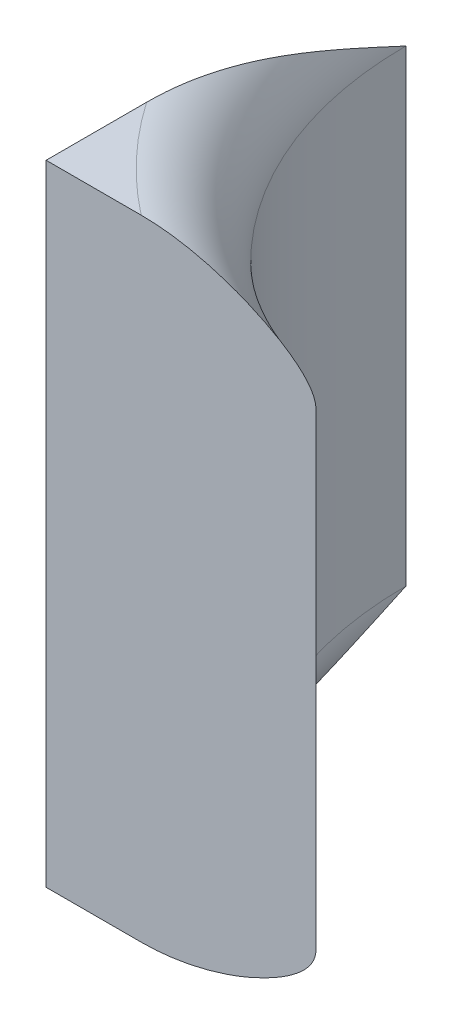
ISO-10303-21;
HEADER;
FILE_DESCRIPTION(('STEP AP214'),'2;1');
FILE_NAME('part.step','',(''),(''),'','','');
FILE_SCHEMA(('AUTOMOTIVE_DESIGN { 1 0 10303 214 1 1 1 1 }'));
ENDSEC;
DATA;
#1=APPLICATION_CONTEXT('core data for automotive mechanical design processes');
#2=APPLICATION_PROTOCOL_DEFINITION('international standard','automotive_design',2000,#1);
#3=PRODUCT_CONTEXT('',#1,'mechanical');
#4=PRODUCT('Part','Part','',(#3));
#5=PRODUCT_RELATED_PRODUCT_CATEGORY('part','',(#4));
#6=PRODUCT_DEFINITION_FORMATION('','',#4);
#7=PRODUCT_DEFINITION_CONTEXT('part definition',#1,'design');
#8=PRODUCT_DEFINITION('design','',#6,#7);
#9=PRODUCT_DEFINITION_SHAPE('','',#8);
#10=(LENGTH_UNIT() NAMED_UNIT(*) SI_UNIT(.MILLI.,.METRE.));
#11=(NAMED_UNIT(*) PLANE_ANGLE_UNIT() SI_UNIT($,.RADIAN.));
#12=(NAMED_UNIT(*) SI_UNIT($,.STERADIAN.) SOLID_ANGLE_UNIT());
#13=UNCERTAINTY_MEASURE_WITH_UNIT(LENGTH_MEASURE(1.E-05),#10,'distance_accuracy_value','');
#14=(GEOMETRIC_REPRESENTATION_CONTEXT(3) GLOBAL_UNCERTAINTY_ASSIGNED_CONTEXT((#13)) GLOBAL_UNIT_ASSIGNED_CONTEXT((#10,
#11,#12)) REPRESENTATION_CONTEXT('',''));
#15=CARTESIAN_POINT('',(0.,0.,0.));
#16=DIRECTION('',(0.,0.,1.));
#17=DIRECTION('',(1.,0.,0.));
#18=AXIS2_PLACEMENT_3D('',#15,#16,#17);
#19=CARTESIAN_POINT('',(-8.18333333333,4.66,-7.4));
#20=DIRECTION('',(0.,1.,0.));
#21=DIRECTION('',(0.,0.,1.));
#22=AXIS2_PLACEMENT_3D('',#19,#20,#21);
#23=TOROIDAL_SURFACE('',#22,0.506666666666999,0.0899999999999992);
#24=CARTESIAN_POINT('',(-8.6,4.75,-7.11172929389331));
#25=CARTESIAN_POINT('',(-8.60000000000004,4.74999182842818,-7.12226420750381));
#26=CARTESIAN_POINT('',(-8.60000000000002,4.74940282433437,-7.13277700192456));
#27=CARTESIAN_POINT('',(-8.59999999999998,4.74726599111461,-7.15367604192472));
#28=CARTESIAN_POINT('',(-8.59999999999996,4.7457210217608,-7.16406257107873));
#29=CARTESIAN_POINT('',(-8.60000000000008,4.73999308609058,-7.19476484291107));
#30=CARTESIAN_POINT('',(-8.60000000000041,4.73470744792433,-7.21486900485835));
#31=CARTESIAN_POINT('',(-8.59999999999942,4.71974800515174,-7.26244598700282));
#32=CARTESIAN_POINT('',(-8.59999999999739,4.70916406833894,-7.28961338372367));
#33=CARTESIAN_POINT('',(-8.60000000000262,4.68630890961603,-7.34329374460435));
#34=CARTESIAN_POINT('',(-8.60000000000991,4.67403179600395,-7.36980402462256));
#35=CARTESIAN_POINT('',(-8.59999999999954,4.66114707398826,-7.39753187914524));
#36=CARTESIAN_POINT('',(-8.59999999999904,4.66057353385867,-7.39876593924196));
#37=CARTESIAN_POINT('',(-8.5999999999985,4.66,-7.4));
#38=B_SPLINE_CURVE_WITH_KNOTS('',3,(#24,#25,#26,#27,#28,#29,#30,#31,#32,#33,#34,#35,#36,#37),
.UNSPECIFIED.,.F.,.F.,(4,2,2,2,2,2,4),(0.,0.03155687643443,0.0630198037860994,0.125216483289171,
0.212547910956125,0.300191273586357,0.304273756561998),.UNSPECIFIED.);
#39=CARTESIAN_POINT('',(-8.6,4.75,-7.11172929389477));
#40=VERTEX_POINT('',#39);
#41=CARTESIAN_POINT('',(-8.5999999999985,4.66,-7.4));
#42=VERTEX_POINT('',#41);
#43=EDGE_CURVE('E67',#40,#42,#38,.T.);
#44=ORIENTED_EDGE('',*,*,#43,.F.);
#45=CARTESIAN_POINT('',(-8.18333333333,4.75,-7.4));
#46=DIRECTION('',(0.,1.,0.));
#47=DIRECTION('',(0.,0.,1.));
#48=AXIS2_PLACEMENT_3D('',#45,#46,#47);
#49=CIRCLE('',#48,0.506666666667);
#50=CARTESIAN_POINT('',(-8.49431743438948,4.75,-7.));
#51=VERTEX_POINT('',#50);
#52=EDGE_CURVE('E21',#51,#40,#49,.F.);
#53=ORIENTED_EDGE('',*,*,#52,.F.);
#54=CARTESIAN_POINT('',(-8.29999999999785,4.66,-7.));
#55=CARTESIAN_POINT('',(-8.2999924228672,4.66179744020447,-7.));
#56=CARTESIAN_POINT('',(-8.30019201367934,4.66358197983579,-7.));
#57=CARTESIAN_POINT('',(-8.300927010424,4.66704597855897,-7.));
#58=CARTESIAN_POINT('',(-8.30145576856262,4.66872681056904,-7.));
#59=CARTESIAN_POINT('',(-8.30298307668688,4.67248809473558,-7.));
#60=CARTESIAN_POINT('',(-8.30407698784922,4.67452839958886,-7.));
#61=CARTESIAN_POINT('',(-8.30656855223291,4.67843047637995,-7.));
#62=CARTESIAN_POINT('',(-8.30796881069487,4.68029050638506,-7.));
#63=CARTESIAN_POINT('',(-8.31323590592021,4.68656410542717,-7.));
#64=CARTESIAN_POINT('',(-8.3176064054637,4.69054368091173,-7.));
#65=CARTESIAN_POINT('',(-8.32682625249036,4.6978895207235,-7.));
#66=CARTESIAN_POINT('',(-8.33167814429885,4.70125222596013,-7.));
#67=CARTESIAN_POINT('',(-8.34367620686637,4.7088269994572,-7.));
#68=CARTESIAN_POINT('',(-8.35095494357624,4.71283059244185,-7.));
#69=CARTESIAN_POINT('',(-8.3658254122037,4.72021324720343,-7.));
#70=CARTESIAN_POINT('',(-8.37341767971984,4.72359118122704,-7.));
#71=CARTESIAN_POINT('',(-8.39649886587155,4.73286895184523,-7.));
#72=CARTESIAN_POINT('',(-8.41233477189956,4.7379375437972,-7.));
#73=CARTESIAN_POINT('',(-8.43925638048751,4.74438694776934,-7.));
#74=CARTESIAN_POINT('',(-8.45018585906077,4.7464327130057,-7.));
#75=CARTESIAN_POINT('',(-8.47217205192401,4.74923061064085,-7.));
#76=CARTESIAN_POINT('',(-8.48322828526269,4.74998661136524,-7.));
#77=CARTESIAN_POINT('',(-8.49431743438942,4.75,-7.));
#78=B_SPLINE_CURVE_WITH_KNOTS('',3,(#54,#55,#56,#57,#58,#59,#60,#61,#62,#63,#64,#65,#66,#67,#68,
#69,#70,#71,#72,#73,#74,#75,#76,#77),.UNSPECIFIED.,.F.,.F.,(4,2,2,2,2,2,2,2,2,2,2,4),(0.,
0.00536075382320547,0.0106166062475381,0.0175220325716459,0.0244886399425492,0.0420846993037856,
0.0597792898738582,0.0846486742987673,0.109562458701924,0.159243487630327,0.192536219053457,
0.225728920570611),.UNSPECIFIED.);
#79=CARTESIAN_POINT('',(-8.29999999999838,4.66,-6.99999999999984));
#80=VERTEX_POINT('',#79);
#81=EDGE_CURVE('E64',#80,#51,#78,.T.);
#82=ORIENTED_EDGE('',*,*,#81,.F.);
#83=CARTESIAN_POINT('',(-8.18333333332787,4.66,-7.4000000000016));
#84=DIRECTION('',(0.,1.,0.));
#85=DIRECTION('',(0.,0.,1.));
#86=AXIS2_PLACEMENT_3D('',#83,#84,#85);
#87=CIRCLE('',#86,0.416666666669132);
#88=EDGE_CURVE('E71',#42,#80,#87,.T.);
#89=ORIENTED_EDGE('',*,*,#88,.F.);
#90=EDGE_LOOP('',(#44,#53,#82,#89));
#91=FACE_BOUND('',#90,.T.);
#92=ADVANCED_FACE('F17',(#91),#23,.T.);
#93=CARTESIAN_POINT('',(-8.601,4.75,-7.11272929389202));
#94=DIRECTION('',(0.,1.,0.));
#95=DIRECTION('',(0.,0.,1.));
#96=AXIS2_PLACEMENT_3D('',#93,#94,#95);
#97=PLANE('',#96);
#98=DIRECTION('',(-1.,0.,0.));
#99=VECTOR('',#98,1.);
#100=CARTESIAN_POINT('',(-8.44999999999893,4.75,-7.));
#101=LINE('',#100,#99);
#102=CARTESIAN_POINT('',(-8.6,4.75,-7.));
#103=VERTEX_POINT('',#102);
#104=EDGE_CURVE('E73',#51,#103,#101,.T.);
#105=ORIENTED_EDGE('',*,*,#104,.F.);
#106=ORIENTED_EDGE('',*,*,#52,.T.);
#107=DIRECTION('',(0.,0.,-1.));
#108=VECTOR('',#107,1.);
#109=CARTESIAN_POINT('',(-8.6,4.75,-7.2));
#110=LINE('',#109,#108);
#111=EDGE_CURVE('E75',#103,#40,#110,.T.);
#112=ORIENTED_EDGE('',*,*,#111,.F.);
#113=EDGE_LOOP('',(#105,#106,#112));
#114=FACE_BOUND('',#113,.T.);
#115=ADVANCED_FACE('F74',(#114),#97,.T.);
#116=CARTESIAN_POINT('',(-8.18333333332787,4.66,-7.4000000000016));
#117=DIRECTION('',(0.,-1.,0.));
#118=DIRECTION('',(0.,0.,-1.));
#119=AXIS2_PLACEMENT_3D('',#116,#117,#118);
#120=CYLINDRICAL_SURFACE('',#119,0.416666666669132);
#121=CARTESIAN_POINT('',(-8.18333333333,4.14,-7.4));
#122=DIRECTION('',(0.,1.,0.));
#123=DIRECTION('',(0.,0.,1.));
#124=AXIS2_PLACEMENT_3D('',#121,#122,#123);
#125=CIRCLE('',#124,0.416666666666999);
#126=CARTESIAN_POINT('',(-8.5999999999985,4.14,-7.4));
#127=VERTEX_POINT('',#126);
#128=CARTESIAN_POINT('',(-8.29999999999893,4.14,-7.));
#129=VERTEX_POINT('',#128);
#130=EDGE_CURVE('E122',#127,#129,#125,.T.);
#131=ORIENTED_EDGE('',*,*,#130,.F.);
#132=DIRECTION('',(0.,-1.,0.));
#133=VECTOR('',#132,1.);
#134=CARTESIAN_POINT('',(-8.6,4.40000000000054,-7.4));
#135=LINE('',#134,#133);
#136=EDGE_CURVE('E82',#42,#127,#135,.T.);
#137=ORIENTED_EDGE('',*,*,#136,.F.);
#138=ORIENTED_EDGE('',*,*,#88,.T.);
#139=DIRECTION('',(0.,1.,0.));
#140=VECTOR('',#139,1.);
#141=CARTESIAN_POINT('',(-8.3,4.39999999999995,-7.));
#142=LINE('',#141,#140);
#143=EDGE_CURVE('E78',#129,#80,#142,.T.);
#144=ORIENTED_EDGE('',*,*,#143,.F.);
#145=EDGE_LOOP('',(#131,#137,#138,#144));
#146=FACE_BOUND('',#145,.T.);
#147=ADVANCED_FACE('F102',(#146),#120,.F.);
#148=CARTESIAN_POINT('',(-8.601,4.7510000000001,-7.));
#149=DIRECTION('',(0.,0.,1.));
#150=DIRECTION('',(0.,-1.,0.));
#151=AXIS2_PLACEMENT_3D('',#148,#149,#150);
#152=PLANE('',#151);
#153=ORIENTED_EDGE('',*,*,#143,.T.);
#154=ORIENTED_EDGE('',*,*,#81,.T.);
#155=ORIENTED_EDGE('',*,*,#104,.T.);
#156=DIRECTION('',(0.,1.,0.));
#157=VECTOR('',#156,1.);
#158=CARTESIAN_POINT('',(-8.6,4.40000000000054,-7.));
#159=LINE('',#158,#157);
#160=CARTESIAN_POINT('',(-8.6,4.05,-7.));
#161=VERTEX_POINT('',#160);
#162=EDGE_CURVE('E133',#161,#103,#159,.T.);
#163=ORIENTED_EDGE('',*,*,#162,.F.);
#164=DIRECTION('',(-1.,0.,0.));
#165=VECTOR('',#164,1.);
#166=CARTESIAN_POINT('',(-8.5471587171948,4.05,-7.));
#167=LINE('',#166,#165);
#168=CARTESIAN_POINT('',(-8.49431743438948,4.05,-7.));
#169=VERTEX_POINT('',#168);
#170=EDGE_CURVE('E120',#169,#161,#167,.T.);
#171=ORIENTED_EDGE('',*,*,#170,.F.);
#172=CARTESIAN_POINT('',(-8.29999999999786,4.14,-7.));
#173=CARTESIAN_POINT('',(-8.2999924228672,4.13820255979553,-7.));
#174=CARTESIAN_POINT('',(-8.30019201367934,4.13641802016421,-7.));
#175=CARTESIAN_POINT('',(-8.300927010424,4.13295402144102,-7.));
#176=CARTESIAN_POINT('',(-8.30145576856262,4.13127318943096,-7.));
#177=CARTESIAN_POINT('',(-8.30298307668689,4.12751190526441,-7.));
#178=CARTESIAN_POINT('',(-8.30407698784922,4.12547160041113,-7.));
#179=CARTESIAN_POINT('',(-8.30656855223291,4.12156952362004,-7.));
#180=CARTESIAN_POINT('',(-8.30796881069488,4.11970949361494,-7.));
#181=CARTESIAN_POINT('',(-8.31323590592021,4.11343589457283,-7.));
#182=CARTESIAN_POINT('',(-8.3176064054637,4.10945631908827,-7.));
#183=CARTESIAN_POINT('',(-8.32682625249036,4.1021104792765,-7.));
#184=CARTESIAN_POINT('',(-8.33167814429885,4.09874777403986,-7.));
#185=CARTESIAN_POINT('',(-8.34367620686638,4.0911730005428,-7.));
#186=CARTESIAN_POINT('',(-8.35095494357624,4.08716940755815,-7.));
#187=CARTESIAN_POINT('',(-8.36582541220371,4.07978675279657,-7.));
#188=CARTESIAN_POINT('',(-8.37341767971984,4.07640881877295,-7.));
#189=CARTESIAN_POINT('',(-8.39649886587156,4.06713104815476,-7.));
#190=CARTESIAN_POINT('',(-8.41233477189956,4.06206245620279,-7.));
#191=CARTESIAN_POINT('',(-8.43925638048752,4.05561305223066,-7.));
#192=CARTESIAN_POINT('',(-8.45018585906077,4.05356728699429,-7.));
#193=CARTESIAN_POINT('',(-8.47217205192402,4.05076938935914,-7.));
#194=CARTESIAN_POINT('',(-8.48322828526269,4.05001338863476,-7.));
#195=CARTESIAN_POINT('',(-8.49431743438942,4.05,-7.));
#196=B_SPLINE_CURVE_WITH_KNOTS('',3,(#172,#173,#174,#175,#176,#177,#178,#179,#180,#181,#182,
#183,#184,#185,#186,#187,#188,#189,#190,#191,#192,#193,#194,#195),.UNSPECIFIED.,.F.,.F.,(4,2,2,
2,2,2,2,2,2,2,2,4),(0.,0.00536075382320461,0.0106166062475389,0.0175220325716491,
0.0244886399425506,0.042084699303787,0.059779289873861,0.0846486742987706,0.109562458701929,
0.159243487630333,0.192536219053462,0.22572892057061),.UNSPECIFIED.);
#197=EDGE_CURVE('E132',#129,#169,#196,.T.);
#198=ORIENTED_EDGE('',*,*,#197,.F.);
#199=EDGE_LOOP('',(#153,#154,#155,#163,#171,#198));
#200=FACE_BOUND('',#199,.T.);
#201=ADVANCED_FACE('F80',(#200),#152,.T.);
#202=CARTESIAN_POINT('',(-8.6,4.04899999999892,-6.999));
#203=DIRECTION('',(-1.,0.,0.));
#204=DIRECTION('',(0.,1.,0.));
#205=AXIS2_PLACEMENT_3D('',#202,#203,#204);
#206=PLANE('',#205);
#207=ORIENTED_EDGE('',*,*,#162,.T.);
#208=ORIENTED_EDGE('',*,*,#111,.T.);
#209=ORIENTED_EDGE('',*,*,#43,.T.);
#210=ORIENTED_EDGE('',*,*,#136,.T.);
#211=CARTESIAN_POINT('',(-8.6,4.05,-7.11172929389331));
#212=CARTESIAN_POINT('',(-8.60000000000004,4.05000817157182,-7.12226420750382));
#213=CARTESIAN_POINT('',(-8.60000000000002,4.05059717566562,-7.13277700192457));
#214=CARTESIAN_POINT('',(-8.59999999999998,4.05273400888539,-7.15367604192474));
#215=CARTESIAN_POINT('',(-8.59999999999996,4.0542789782392,-7.16406257107874));
#216=CARTESIAN_POINT('',(-8.60000000000008,4.06000691390942,-7.19476484291109));
#217=CARTESIAN_POINT('',(-8.60000000000041,4.06529255207568,-7.21486900485835));
#218=CARTESIAN_POINT('',(-8.59999999999942,4.08025199484825,-7.26244598700283));
#219=CARTESIAN_POINT('',(-8.59999999999739,4.09083593166103,-7.28961338372368));
#220=CARTESIAN_POINT('',(-8.60000000000262,4.113691090384,-7.34329374460433));
#221=CARTESIAN_POINT('',(-8.60000000000991,4.12596820399616,-7.36980402462251));
#222=CARTESIAN_POINT('',(-8.59999999999954,4.13885292601175,-7.39753187914524));
#223=CARTESIAN_POINT('',(-8.59999999999904,4.13942646614134,-7.39876593924196));
#224=CARTESIAN_POINT('',(-8.5999999999985,4.14,-7.4));
#225=B_SPLINE_CURVE_WITH_KNOTS('',3,(#211,#212,#213,#214,#215,#216,#217,#218,#219,#220,#221,
#222,#223,#224),.UNSPECIFIED.,.F.,.F.,(4,2,2,2,2,2,4),(0.,0.0315568764344414,0.0630198037861189,
0.125216483289175,0.212547910956122,0.300191273586356,0.304273756561998),.UNSPECIFIED.);
#226=CARTESIAN_POINT('',(-8.6,4.05,-7.11172929389478));
#227=VERTEX_POINT('',#226);
#228=EDGE_CURVE('E36',#227,#127,#225,.T.);
#229=ORIENTED_EDGE('',*,*,#228,.F.);
#230=DIRECTION('',(0.,0.,-1.));
#231=VECTOR('',#230,1.);
#232=CARTESIAN_POINT('',(-8.6,4.05,-7.05586464694601));
#233=LINE('',#232,#231);
#234=EDGE_CURVE('E27',#161,#227,#233,.T.);
#235=ORIENTED_EDGE('',*,*,#234,.F.);
#236=EDGE_LOOP('',(#207,#208,#209,#210,#229,#235));
#237=FACE_BOUND('',#236,.T.);
#238=ADVANCED_FACE('F109',(#237),#206,.T.);
#239=CARTESIAN_POINT('',(-8.18333333333,4.14,-7.4));
#240=DIRECTION('',(0.,-1.,0.));
#241=DIRECTION('',(0.,0.,-1.));
#242=AXIS2_PLACEMENT_3D('',#239,#240,#241);
#243=TOROIDAL_SURFACE('',#242,0.506666666667001,0.0900000000000016);
#244=ORIENTED_EDGE('',*,*,#228,.T.);
#245=ORIENTED_EDGE('',*,*,#130,.T.);
#246=ORIENTED_EDGE('',*,*,#197,.T.);
#247=CARTESIAN_POINT('',(-8.18333333333,4.05,-7.4));
#248=DIRECTION('',(0.,-1.,0.));
#249=DIRECTION('',(0.,0.,-1.));
#250=AXIS2_PLACEMENT_3D('',#247,#248,#249);
#251=CIRCLE('',#250,0.506666666666997);
#252=EDGE_CURVE('E11',#227,#169,#251,.F.);
#253=ORIENTED_EDGE('',*,*,#252,.F.);
#254=EDGE_LOOP('',(#244,#245,#246,#253));
#255=FACE_BOUND('',#254,.T.);
#256=ADVANCED_FACE('F112',(#255),#243,.T.);
#257=CARTESIAN_POINT('',(-8.601,4.05,-6.999));
#258=DIRECTION('',(0.,-1.,0.));
#259=DIRECTION('',(0.,0.,-1.));
#260=AXIS2_PLACEMENT_3D('',#257,#258,#259);
#261=PLANE('',#260);
#262=ORIENTED_EDGE('',*,*,#234,.T.);
#263=ORIENTED_EDGE('',*,*,#252,.T.);
#264=ORIENTED_EDGE('',*,*,#170,.T.);
#265=EDGE_LOOP('',(#262,#263,#264));
#266=FACE_BOUND('',#265,.T.);
#267=ADVANCED_FACE('F19',(#266),#261,.T.);
#268=CLOSED_SHELL('',(#92,#115,#147,#201,#238,#256,#267));
#269=MANIFOLD_SOLID_BREP('B1',#268);
#270=ADVANCED_BREP_SHAPE_REPRESENTATION('',(#18,#269),#14);
#271=SHAPE_DEFINITION_REPRESENTATION(#9,#270);
ENDSEC;
END-ISO-10303-21;
